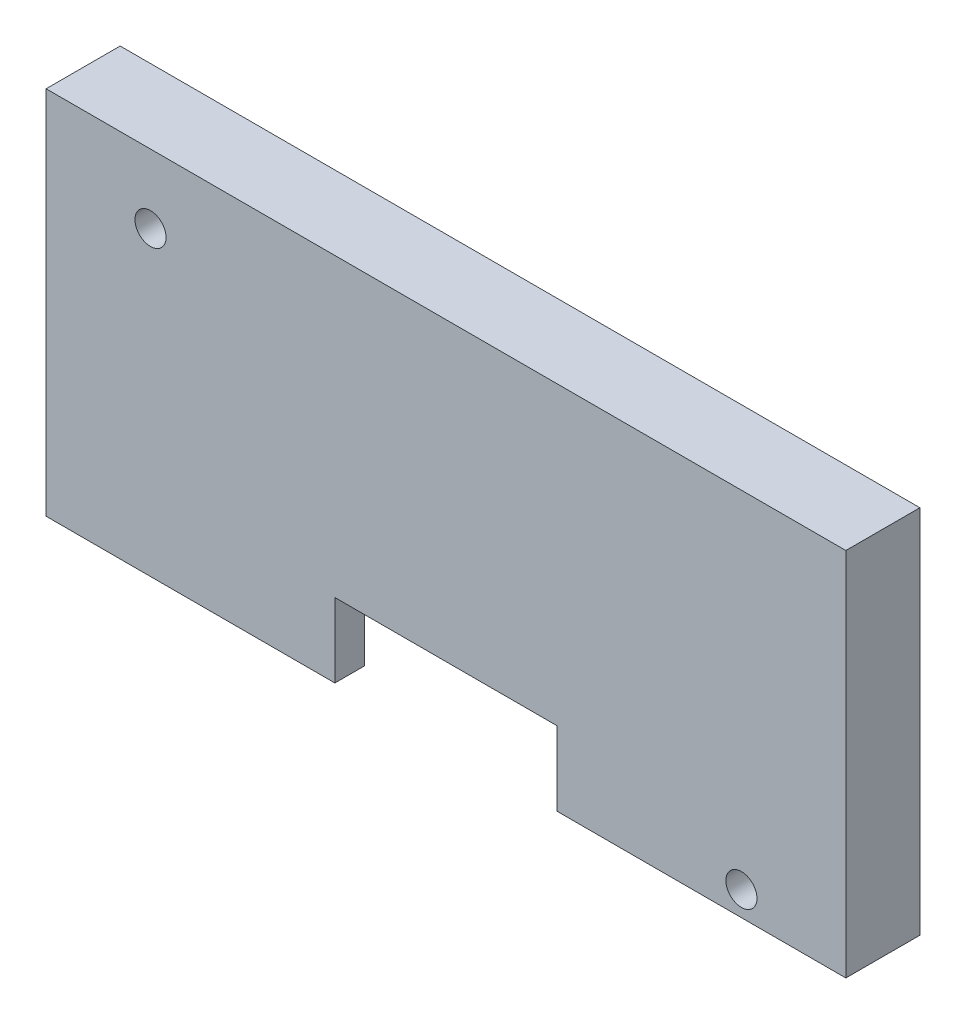
ISO-10303-21;
HEADER;
FILE_DESCRIPTION(('STEP AP214'),'2;1');
FILE_NAME('part.step','',(''),(''),'','','');
FILE_SCHEMA(('AUTOMOTIVE_DESIGN { 1 0 10303 214 1 1 1 1 }'));
ENDSEC;
DATA;
#1=APPLICATION_CONTEXT('core data for automotive mechanical design processes');
#2=APPLICATION_PROTOCOL_DEFINITION('international standard','automotive_design',2000,#1);
#3=PRODUCT_CONTEXT('',#1,'mechanical');
#4=PRODUCT('Part','Part','',(#3));
#5=PRODUCT_RELATED_PRODUCT_CATEGORY('part','',(#4));
#6=PRODUCT_DEFINITION_FORMATION('','',#4);
#7=PRODUCT_DEFINITION_CONTEXT('part definition',#1,'design');
#8=PRODUCT_DEFINITION('design','',#6,#7);
#9=PRODUCT_DEFINITION_SHAPE('','',#8);
#10=(LENGTH_UNIT() NAMED_UNIT(*) SI_UNIT(.MILLI.,.METRE.));
#11=(NAMED_UNIT(*) PLANE_ANGLE_UNIT() SI_UNIT($,.RADIAN.));
#12=(NAMED_UNIT(*) SI_UNIT($,.STERADIAN.) SOLID_ANGLE_UNIT());
#13=UNCERTAINTY_MEASURE_WITH_UNIT(LENGTH_MEASURE(1.E-05),#10,'distance_accuracy_value','');
#14=(GEOMETRIC_REPRESENTATION_CONTEXT(3) GLOBAL_UNCERTAINTY_ASSIGNED_CONTEXT((#13)) GLOBAL_UNIT_ASSIGNED_CONTEXT((#10,
#11,#12)) REPRESENTATION_CONTEXT('',''));
#15=CARTESIAN_POINT('',(0.,0.,0.));
#16=DIRECTION('',(0.,0.,1.));
#17=DIRECTION('',(1.,0.,0.));
#18=AXIS2_PLACEMENT_3D('',#15,#16,#17);
#19=CARTESIAN_POINT('',(-16.9631728808427,-17.5815625675434,5.));
#20=DIRECTION('',(0.,1.,0.));
#21=DIRECTION('',(0.,0.,1.));
#22=AXIS2_PLACEMENT_3D('',#19,#20,#21);
#23=PLANE('',#22);
#24=DIRECTION('',(0.,0.,-1.));
#25=VECTOR('',#24,1.);
#26=CARTESIAN_POINT('',(17.5368271191573,-17.5815625675434,18.));
#27=LINE('',#26,#25);
#28=CARTESIAN_POINT('',(17.5368271191573,-17.5815625675434,5.));
#29=VERTEX_POINT('',#28);
#30=CARTESIAN_POINT('',(17.5368271191573,-17.5815625675434,3.));
#31=VERTEX_POINT('',#30);
#32=EDGE_CURVE('E126',#29,#31,#27,.T.);
#33=ORIENTED_EDGE('',*,*,#32,.T.);
#34=DIRECTION('',(1.,0.,0.));
#35=VECTOR('',#34,1.);
#36=CARTESIAN_POINT('',(-14.9631728808427,-17.5815625675434,3.));
#37=LINE('',#36,#35);
#38=CARTESIAN_POINT('',(35.0368271191573,-17.5815625675434,3.));
#39=VERTEX_POINT('',#38);
#40=EDGE_CURVE('E205',#31,#39,#37,.T.);
#41=ORIENTED_EDGE('',*,*,#40,.T.);
#42=DIRECTION('',(0.,0.,-1.));
#43=VECTOR('',#42,1.);
#44=CARTESIAN_POINT('',(35.0368271191573,-17.5815625675434,3.));
#45=LINE('',#44,#43);
#46=CARTESIAN_POINT('',(35.0368271191573,-17.5815625675434,0.));
#47=VERTEX_POINT('',#46);
#48=EDGE_CURVE('E232',#39,#47,#45,.T.);
#49=ORIENTED_EDGE('',*,*,#48,.T.);
#50=DIRECTION('',(1.,0.,0.));
#51=VECTOR('',#50,1.);
#52=CARTESIAN_POINT('',(-16.9631728808427,-17.5815625675434,0.));
#53=LINE('',#52,#51);
#54=CARTESIAN_POINT('',(37.0368271191573,-17.5815625675434,0.));
#55=VERTEX_POINT('',#54);
#56=EDGE_CURVE('E168',#47,#55,#53,.T.);
#57=ORIENTED_EDGE('',*,*,#56,.T.);
#58=DIRECTION('',(0.,0.,-1.));
#59=VECTOR('',#58,1.);
#60=CARTESIAN_POINT('',(37.0368271191573,-17.5815625675434,5.));
#61=LINE('',#60,#59);
#62=CARTESIAN_POINT('',(37.0368271191573,-17.5815625675434,5.));
#63=VERTEX_POINT('',#62);
#64=EDGE_CURVE('E148',#63,#55,#61,.T.);
#65=ORIENTED_EDGE('',*,*,#64,.F.);
#66=DIRECTION('',(1.,0.,0.));
#67=VECTOR('',#66,1.);
#68=CARTESIAN_POINT('',(-16.9631728808427,-17.5815625675434,5.));
#69=LINE('',#68,#67);
#70=EDGE_CURVE('E141',#29,#63,#69,.T.);
#71=ORIENTED_EDGE('',*,*,#70,.F.);
#72=EDGE_LOOP('',(#33,#41,#49,#57,#65,#71));
#73=FACE_BOUND('',#72,.T.);
#74=ADVANCED_FACE('F38',(#73),#23,.F.);
#75=DIRECTION('',(0.,0.,-1.));
#76=VECTOR('',#75,1.);
#77=CARTESIAN_POINT('',(2.53682711915725,-17.5815625675434,18.));
#78=LINE('',#77,#76);
#79=CARTESIAN_POINT('',(2.53682711915725,-17.5815625675434,5.));
#80=VERTEX_POINT('',#79);
#81=CARTESIAN_POINT('',(2.53682711915725,-17.5815625675434,3.));
#82=VERTEX_POINT('',#81);
#83=EDGE_CURVE('E53',#80,#82,#78,.T.);
#84=ORIENTED_EDGE('',*,*,#83,.F.);
#85=CARTESIAN_POINT('',(-16.9631728808427,-17.5815625675434,5.));
#86=VERTEX_POINT('',#85);
#87=EDGE_CURVE('E150',#86,#80,#69,.T.);
#88=ORIENTED_EDGE('',*,*,#87,.F.);
#89=DIRECTION('',(0.,0.,-1.));
#90=VECTOR('',#89,1.);
#91=CARTESIAN_POINT('',(-16.9631728808427,-17.5815625675434,5.));
#92=LINE('',#91,#90);
#93=CARTESIAN_POINT('',(-16.9631728808427,-17.5815625675434,0.));
#94=VERTEX_POINT('',#93);
#95=EDGE_CURVE('E182',#86,#94,#92,.T.);
#96=ORIENTED_EDGE('',*,*,#95,.T.);
#97=CARTESIAN_POINT('',(-14.9631728808427,-17.5815625675434,0.));
#98=VERTEX_POINT('',#97);
#99=EDGE_CURVE('E170',#94,#98,#53,.T.);
#100=ORIENTED_EDGE('',*,*,#99,.T.);
#101=DIRECTION('',(0.,0.,-1.));
#102=VECTOR('',#101,1.);
#103=CARTESIAN_POINT('',(-14.9631728808427,-17.5815625675434,3.));
#104=LINE('',#103,#102);
#105=CARTESIAN_POINT('',(-14.9631728808427,-17.5815625675434,3.));
#106=VERTEX_POINT('',#105);
#107=EDGE_CURVE('E169',#106,#98,#104,.T.);
#108=ORIENTED_EDGE('',*,*,#107,.F.);
#109=EDGE_CURVE('E210',#106,#82,#37,.T.);
#110=ORIENTED_EDGE('',*,*,#109,.T.);
#111=EDGE_LOOP('',(#84,#88,#96,#100,#108,#110));
#112=FACE_BOUND('',#111,.T.);
#113=ADVANCED_FACE('F241',(#112),#23,.F.);
#114=CARTESIAN_POINT('',(0.,0.,5.));
#115=DIRECTION('',(0.,0.,1.));
#116=DIRECTION('',(1.,0.,0.));
#117=AXIS2_PLACEMENT_3D('',#114,#115,#116);
#118=PLANE('',#117);
#119=CARTESIAN_POINT('',(-9.91317288084275,2.76843743245664,5.));
#120=DIRECTION('',(0.,0.,1.));
#121=DIRECTION('',(1.,0.,0.));
#122=AXIS2_PLACEMENT_3D('',#119,#120,#121);
#123=CIRCLE('',#122,1.05);
#124=CARTESIAN_POINT('',(-8.86317288084275,2.76843743245664,5.));
#125=VERTEX_POINT('',#124);
#126=EDGE_CURVE('E192',#125,#125,#123,.F.);
#127=ORIENTED_EDGE('',*,*,#126,.T.);
#128=EDGE_LOOP('',(#127));
#129=FACE_BOUND('',#128,.T.);
#130=CARTESIAN_POINT('',(29.9868271191573,-15.9315625675434,5.));
#131=DIRECTION('',(0.,0.,1.));
#132=DIRECTION('',(1.,0.,0.));
#133=AXIS2_PLACEMENT_3D('',#130,#131,#132);
#134=CIRCLE('',#133,1.05);
#135=CARTESIAN_POINT('',(31.0368271191573,-15.9315625675434,5.));
#136=VERTEX_POINT('',#135);
#137=EDGE_CURVE('E188',#136,#136,#134,.F.);
#138=ORIENTED_EDGE('',*,*,#137,.T.);
#139=EDGE_LOOP('',(#138));
#140=FACE_BOUND('',#139,.T.);
#141=DIRECTION('',(1.,0.,0.));
#142=VECTOR('',#141,1.);
#143=CARTESIAN_POINT('',(0.,-12.5815625675434,5.));
#144=LINE('',#143,#142);
#145=CARTESIAN_POINT('',(2.53682711915725,-12.5815625675434,5.));
#146=VERTEX_POINT('',#145);
#147=CARTESIAN_POINT('',(17.5368271191573,-12.5815625675434,5.));
#148=VERTEX_POINT('',#147);
#149=EDGE_CURVE('E144',#146,#148,#144,.T.);
#150=ORIENTED_EDGE('',*,*,#149,.T.);
#151=DIRECTION('',(0.,-1.,0.));
#152=VECTOR('',#151,1.);
#153=CARTESIAN_POINT('',(17.5368271191573,0.,5.));
#154=LINE('',#153,#152);
#155=EDGE_CURVE('E130',#148,#29,#154,.T.);
#156=ORIENTED_EDGE('',*,*,#155,.T.);
#157=ORIENTED_EDGE('',*,*,#70,.T.);
#158=DIRECTION('',(0.,-1.,0.));
#159=VECTOR('',#158,1.);
#160=CARTESIAN_POINT('',(37.0368271191573,7.41843743245665,5.));
#161=LINE('',#160,#159);
#162=CARTESIAN_POINT('',(37.0368271191573,7.41843743245665,5.));
#163=VERTEX_POINT('',#162);
#164=EDGE_CURVE('E154',#163,#63,#161,.T.);
#165=ORIENTED_EDGE('',*,*,#164,.F.);
#166=DIRECTION('',(1.,0.,0.));
#167=VECTOR('',#166,1.);
#168=CARTESIAN_POINT('',(-16.9631728808428,7.41843743245665,5.));
#169=LINE('',#168,#167);
#170=CARTESIAN_POINT('',(-16.9631728808428,7.41843743245665,5.));
#171=VERTEX_POINT('',#170);
#172=EDGE_CURVE('E161',#171,#163,#169,.T.);
#173=ORIENTED_EDGE('',*,*,#172,.F.);
#174=DIRECTION('',(0.,-1.,0.));
#175=VECTOR('',#174,1.);
#176=CARTESIAN_POINT('',(-16.9631728808428,7.41843743245665,5.));
#177=LINE('',#176,#175);
#178=EDGE_CURVE('E151',#171,#86,#177,.T.);
#179=ORIENTED_EDGE('',*,*,#178,.T.);
#180=ORIENTED_EDGE('',*,*,#87,.T.);
#181=DIRECTION('',(0.,1.,0.));
#182=VECTOR('',#181,1.);
#183=CARTESIAN_POINT('',(2.53682711915725,0.,5.));
#184=LINE('',#183,#182);
#185=EDGE_CURVE('E201',#80,#146,#184,.T.);
#186=ORIENTED_EDGE('',*,*,#185,.T.);
#187=EDGE_LOOP('',(#150,#156,#157,#165,#173,#179,#180,#186));
#188=FACE_BOUND('',#187,.T.);
#189=ADVANCED_FACE('F139',(#129,#140,#188),#118,.T.);
#190=CARTESIAN_POINT('',(0.,0.,3.));
#191=DIRECTION('',(0.,0.,1.));
#192=DIRECTION('',(1.,0.,0.));
#193=AXIS2_PLACEMENT_3D('',#190,#191,#192);
#194=PLANE('',#193);
#195=CARTESIAN_POINT('',(29.9868271191573,-15.9315625675434,3.));
#196=DIRECTION('',(0.,0.,1.));
#197=DIRECTION('',(1.,0.,0.));
#198=AXIS2_PLACEMENT_3D('',#195,#196,#197);
#199=CIRCLE('',#198,1.05);
#200=CARTESIAN_POINT('',(31.0368271191573,-15.9315625675434,3.));
#201=VERTEX_POINT('',#200);
#202=EDGE_CURVE('E145',#201,#201,#199,.F.);
#203=ORIENTED_EDGE('',*,*,#202,.F.);
#204=EDGE_LOOP('',(#203));
#205=FACE_BOUND('',#204,.T.);
#206=CARTESIAN_POINT('',(-9.91317288084275,2.76843743245664,3.));
#207=DIRECTION('',(0.,0.,1.));
#208=DIRECTION('',(1.,0.,0.));
#209=AXIS2_PLACEMENT_3D('',#206,#207,#208);
#210=CIRCLE('',#209,1.05);
#211=CARTESIAN_POINT('',(-8.86317288084275,2.76843743245664,3.));
#212=VERTEX_POINT('',#211);
#213=EDGE_CURVE('E189',#212,#212,#210,.F.);
#214=ORIENTED_EDGE('',*,*,#213,.F.);
#215=EDGE_LOOP('',(#214));
#216=FACE_BOUND('',#215,.T.);
#217=DIRECTION('',(0.,-1.,0.));
#218=VECTOR('',#217,1.);
#219=CARTESIAN_POINT('',(17.5368271191573,0.,3.));
#220=LINE('',#219,#218);
#221=CARTESIAN_POINT('',(17.5368271191573,-12.5815625675434,3.));
#222=VERTEX_POINT('',#221);
#223=EDGE_CURVE('E11',#222,#31,#220,.T.);
#224=ORIENTED_EDGE('',*,*,#223,.F.);
#225=DIRECTION('',(1.,0.,0.));
#226=VECTOR('',#225,1.);
#227=CARTESIAN_POINT('',(0.,-12.5815625675434,3.));
#228=LINE('',#227,#226);
#229=CARTESIAN_POINT('',(2.53682711915725,-12.5815625675434,3.));
#230=VERTEX_POINT('',#229);
#231=EDGE_CURVE('E46',#230,#222,#228,.T.);
#232=ORIENTED_EDGE('',*,*,#231,.F.);
#233=DIRECTION('',(0.,1.,0.));
#234=VECTOR('',#233,1.);
#235=CARTESIAN_POINT('',(2.53682711915725,0.,3.));
#236=LINE('',#235,#234);
#237=EDGE_CURVE('E185',#82,#230,#236,.T.);
#238=ORIENTED_EDGE('',*,*,#237,.F.);
#239=ORIENTED_EDGE('',*,*,#109,.F.);
#240=DIRECTION('',(0.,-1.,0.));
#241=VECTOR('',#240,1.);
#242=CARTESIAN_POINT('',(-14.9631728808427,4.41843743245664,3.));
#243=LINE('',#242,#241);
#244=CARTESIAN_POINT('',(-14.9631728808427,4.41843743245664,3.));
#245=VERTEX_POINT('',#244);
#246=EDGE_CURVE('E211',#245,#106,#243,.T.);
#247=ORIENTED_EDGE('',*,*,#246,.F.);
#248=DIRECTION('',(-1.,0.,0.));
#249=VECTOR('',#248,1.);
#250=CARTESIAN_POINT('',(-14.9631728808427,4.41843743245664,3.));
#251=LINE('',#250,#249);
#252=CARTESIAN_POINT('',(35.0368271191573,4.41843743245664,3.));
#253=VERTEX_POINT('',#252);
#254=EDGE_CURVE('E220',#253,#245,#251,.T.);
#255=ORIENTED_EDGE('',*,*,#254,.F.);
#256=DIRECTION('',(0.,1.,0.));
#257=VECTOR('',#256,1.);
#258=CARTESIAN_POINT('',(35.0368271191573,4.41843743245664,3.));
#259=LINE('',#258,#257);
#260=EDGE_CURVE('E207',#39,#253,#259,.T.);
#261=ORIENTED_EDGE('',*,*,#260,.F.);
#262=ORIENTED_EDGE('',*,*,#40,.F.);
#263=EDGE_LOOP('',(#224,#232,#238,#239,#247,#255,#261,#262));
#264=FACE_BOUND('',#263,.T.);
#265=ADVANCED_FACE('F203',(#205,#216,#264),#194,.F.);
#266=CARTESIAN_POINT('',(0.,0.,0.));
#267=DIRECTION('',(0.,0.,1.));
#268=DIRECTION('',(1.,0.,0.));
#269=AXIS2_PLACEMENT_3D('',#266,#267,#268);
#270=PLANE('',#269);
#271=DIRECTION('',(0.,-1.,0.));
#272=VECTOR('',#271,1.);
#273=CARTESIAN_POINT('',(-14.9631728808427,4.41843743245664,0.));
#274=LINE('',#273,#272);
#275=CARTESIAN_POINT('',(-14.9631728808427,4.41843743245664,0.));
#276=VERTEX_POINT('',#275);
#277=EDGE_CURVE('E61',#276,#98,#274,.T.);
#278=ORIENTED_EDGE('',*,*,#277,.T.);
#279=ORIENTED_EDGE('',*,*,#99,.F.);
#280=DIRECTION('',(0.,-1.,0.));
#281=VECTOR('',#280,1.);
#282=CARTESIAN_POINT('',(-16.9631728808428,7.41843743245665,0.));
#283=LINE('',#282,#281);
#284=CARTESIAN_POINT('',(-16.9631728808428,7.41843743245665,0.));
#285=VERTEX_POINT('',#284);
#286=EDGE_CURVE('E165',#285,#94,#283,.T.);
#287=ORIENTED_EDGE('',*,*,#286,.F.);
#288=DIRECTION('',(1.,0.,0.));
#289=VECTOR('',#288,1.);
#290=CARTESIAN_POINT('',(-16.9631728808428,7.41843743245665,0.));
#291=LINE('',#290,#289);
#292=CARTESIAN_POINT('',(37.0368271191573,7.41843743245665,0.));
#293=VERTEX_POINT('',#292);
#294=EDGE_CURVE('E156',#285,#293,#291,.T.);
#295=ORIENTED_EDGE('',*,*,#294,.T.);
#296=DIRECTION('',(0.,-1.,0.));
#297=VECTOR('',#296,1.);
#298=CARTESIAN_POINT('',(37.0368271191573,7.41843743245665,0.));
#299=LINE('',#298,#297);
#300=EDGE_CURVE('E173',#293,#55,#299,.T.);
#301=ORIENTED_EDGE('',*,*,#300,.T.);
#302=ORIENTED_EDGE('',*,*,#56,.F.);
#303=DIRECTION('',(0.,1.,0.));
#304=VECTOR('',#303,1.);
#305=CARTESIAN_POINT('',(35.0368271191573,4.41843743245664,0.));
#306=LINE('',#305,#304);
#307=CARTESIAN_POINT('',(35.0368271191573,4.41843743245664,0.));
#308=VERTEX_POINT('',#307);
#309=EDGE_CURVE('E224',#47,#308,#306,.T.);
#310=ORIENTED_EDGE('',*,*,#309,.T.);
#311=DIRECTION('',(-1.,0.,0.));
#312=VECTOR('',#311,1.);
#313=CARTESIAN_POINT('',(-14.9631728808427,4.41843743245664,0.));
#314=LINE('',#313,#312);
#315=EDGE_CURVE('E215',#308,#276,#314,.T.);
#316=ORIENTED_EDGE('',*,*,#315,.T.);
#317=EDGE_LOOP('',(#278,#279,#287,#295,#301,#302,#310,#316));
#318=FACE_BOUND('',#317,.T.);
#319=ADVANCED_FACE('F238',(#318),#270,.F.);
#320=CARTESIAN_POINT('',(-16.9631728808428,7.41843743245665,5.));
#321=DIRECTION('',(1.,0.,0.));
#322=DIRECTION('',(0.,1.,0.));
#323=AXIS2_PLACEMENT_3D('',#320,#321,#322);
#324=PLANE('',#323);
#325=ORIENTED_EDGE('',*,*,#286,.T.);
#326=ORIENTED_EDGE('',*,*,#95,.F.);
#327=ORIENTED_EDGE('',*,*,#178,.F.);
#328=DIRECTION('',(0.,0.,-1.));
#329=VECTOR('',#328,1.);
#330=CARTESIAN_POINT('',(-16.9631728808428,7.41843743245665,5.));
#331=LINE('',#330,#329);
#332=EDGE_CURVE('E164',#171,#285,#331,.T.);
#333=ORIENTED_EDGE('',*,*,#332,.T.);
#334=EDGE_LOOP('',(#325,#326,#327,#333));
#335=FACE_BOUND('',#334,.T.);
#336=ADVANCED_FACE('F40',(#335),#324,.F.);
#337=CARTESIAN_POINT('',(37.0368271191573,7.41843743245665,5.));
#338=DIRECTION('',(1.,0.,0.));
#339=DIRECTION('',(0.,1.,0.));
#340=AXIS2_PLACEMENT_3D('',#337,#338,#339);
#341=PLANE('',#340);
#342=ORIENTED_EDGE('',*,*,#300,.F.);
#343=DIRECTION('',(0.,0.,-1.));
#344=VECTOR('',#343,1.);
#345=CARTESIAN_POINT('',(37.0368271191573,7.41843743245665,5.));
#346=LINE('',#345,#344);
#347=EDGE_CURVE('E179',#163,#293,#346,.T.);
#348=ORIENTED_EDGE('',*,*,#347,.F.);
#349=ORIENTED_EDGE('',*,*,#164,.T.);
#350=ORIENTED_EDGE('',*,*,#64,.T.);
#351=EDGE_LOOP('',(#342,#348,#349,#350));
#352=FACE_BOUND('',#351,.T.);
#353=ADVANCED_FACE('F251',(#352),#341,.T.);
#354=CARTESIAN_POINT('',(-16.9631728808428,7.41843743245665,5.));
#355=DIRECTION('',(0.,1.,0.));
#356=DIRECTION('',(0.,0.,1.));
#357=AXIS2_PLACEMENT_3D('',#354,#355,#356);
#358=PLANE('',#357);
#359=ORIENTED_EDGE('',*,*,#294,.F.);
#360=ORIENTED_EDGE('',*,*,#332,.F.);
#361=ORIENTED_EDGE('',*,*,#172,.T.);
#362=ORIENTED_EDGE('',*,*,#347,.T.);
#363=EDGE_LOOP('',(#359,#360,#361,#362));
#364=FACE_BOUND('',#363,.T.);
#365=ADVANCED_FACE('F247',(#364),#358,.T.);
#366=CARTESIAN_POINT('',(-14.9631728808427,4.41843743245664,3.));
#367=DIRECTION('',(1.,0.,0.));
#368=DIRECTION('',(0.,0.,-1.));
#369=AXIS2_PLACEMENT_3D('',#366,#367,#368);
#370=PLANE('',#369);
#371=ORIENTED_EDGE('',*,*,#277,.F.);
#372=DIRECTION('',(0.,0.,-1.));
#373=VECTOR('',#372,1.);
#374=CARTESIAN_POINT('',(-14.9631728808427,4.41843743245664,3.));
#375=LINE('',#374,#373);
#376=EDGE_CURVE('E222',#245,#276,#375,.T.);
#377=ORIENTED_EDGE('',*,*,#376,.F.);
#378=ORIENTED_EDGE('',*,*,#246,.T.);
#379=ORIENTED_EDGE('',*,*,#107,.T.);
#380=EDGE_LOOP('',(#371,#377,#378,#379));
#381=FACE_BOUND('',#380,.T.);
#382=ADVANCED_FACE('F234',(#381),#370,.T.);
#383=CARTESIAN_POINT('',(35.0368271191573,4.41843743245664,3.));
#384=DIRECTION('',(-1.,0.,0.));
#385=DIRECTION('',(0.,0.,1.));
#386=AXIS2_PLACEMENT_3D('',#383,#384,#385);
#387=PLANE('',#386);
#388=ORIENTED_EDGE('',*,*,#309,.F.);
#389=ORIENTED_EDGE('',*,*,#48,.F.);
#390=ORIENTED_EDGE('',*,*,#260,.T.);
#391=DIRECTION('',(0.,0.,-1.));
#392=VECTOR('',#391,1.);
#393=CARTESIAN_POINT('',(35.0368271191573,4.41843743245664,3.));
#394=LINE('',#393,#392);
#395=EDGE_CURVE('E230',#253,#308,#394,.T.);
#396=ORIENTED_EDGE('',*,*,#395,.T.);
#397=EDGE_LOOP('',(#388,#389,#390,#396));
#398=FACE_BOUND('',#397,.T.);
#399=ADVANCED_FACE('F254',(#398),#387,.T.);
#400=CARTESIAN_POINT('',(-14.9631728808427,4.41843743245664,3.));
#401=DIRECTION('',(0.,-1.,0.));
#402=DIRECTION('',(0.,0.,-1.));
#403=AXIS2_PLACEMENT_3D('',#400,#401,#402);
#404=PLANE('',#403);
#405=ORIENTED_EDGE('',*,*,#315,.F.);
#406=ORIENTED_EDGE('',*,*,#395,.F.);
#407=ORIENTED_EDGE('',*,*,#254,.T.);
#408=ORIENTED_EDGE('',*,*,#376,.T.);
#409=EDGE_LOOP('',(#405,#406,#407,#408));
#410=FACE_BOUND('',#409,.T.);
#411=ADVANCED_FACE('F257',(#410),#404,.T.);
#412=CARTESIAN_POINT('',(29.9868271191573,-15.9315625675434,17.));
#413=DIRECTION('',(0.,0.,-1.));
#414=DIRECTION('',(-1.,0.,0.));
#415=AXIS2_PLACEMENT_3D('',#412,#413,#414);
#416=CYLINDRICAL_SURFACE('',#415,1.05);
#417=ORIENTED_EDGE('',*,*,#137,.F.);
#418=EDGE_LOOP('',(#417));
#419=FACE_BOUND('',#418,.T.);
#420=ORIENTED_EDGE('',*,*,#202,.T.);
#421=EDGE_LOOP('',(#420));
#422=FACE_BOUND('',#421,.T.);
#423=ADVANCED_FACE('F272',(#419,#422),#416,.F.);
#424=CARTESIAN_POINT('',(-9.91317288084275,2.76843743245664,17.));
#425=DIRECTION('',(0.,0.,-1.));
#426=DIRECTION('',(-1.,0.,0.));
#427=AXIS2_PLACEMENT_3D('',#424,#425,#426);
#428=CYLINDRICAL_SURFACE('',#427,1.05);
#429=ORIENTED_EDGE('',*,*,#126,.F.);
#430=EDGE_LOOP('',(#429));
#431=FACE_BOUND('',#430,.T.);
#432=ORIENTED_EDGE('',*,*,#213,.T.);
#433=EDGE_LOOP('',(#432));
#434=FACE_BOUND('',#433,.T.);
#435=ADVANCED_FACE('F269',(#431,#434),#428,.F.);
#436=CARTESIAN_POINT('',(17.5368271191573,-12.5815625675434,18.));
#437=DIRECTION('',(-1.,0.,0.));
#438=DIRECTION('',(0.,0.,1.));
#439=AXIS2_PLACEMENT_3D('',#436,#437,#438);
#440=PLANE('',#439);
#441=DIRECTION('',(0.,0.,-1.));
#442=VECTOR('',#441,1.);
#443=CARTESIAN_POINT('',(17.5368271191573,-12.5815625675434,18.));
#444=LINE('',#443,#442);
#445=EDGE_CURVE('E197',#148,#222,#444,.T.);
#446=ORIENTED_EDGE('',*,*,#445,.T.);
#447=ORIENTED_EDGE('',*,*,#223,.T.);
#448=ORIENTED_EDGE('',*,*,#32,.F.);
#449=ORIENTED_EDGE('',*,*,#155,.F.);
#450=EDGE_LOOP('',(#446,#447,#448,#449));
#451=FACE_BOUND('',#450,.T.);
#452=ADVANCED_FACE('F129',(#451),#440,.T.);
#453=CARTESIAN_POINT('',(17.5368271191573,-12.5815625675434,18.));
#454=DIRECTION('',(0.,-1.,0.));
#455=DIRECTION('',(1.,0.,0.));
#456=AXIS2_PLACEMENT_3D('',#453,#454,#455);
#457=PLANE('',#456);
#458=DIRECTION('',(0.,0.,-1.));
#459=VECTOR('',#458,1.);
#460=CARTESIAN_POINT('',(2.53682711915725,-12.5815625675434,18.));
#461=LINE('',#460,#459);
#462=EDGE_CURVE('E199',#146,#230,#461,.T.);
#463=ORIENTED_EDGE('',*,*,#462,.T.);
#464=ORIENTED_EDGE('',*,*,#231,.T.);
#465=ORIENTED_EDGE('',*,*,#445,.F.);
#466=ORIENTED_EDGE('',*,*,#149,.F.);
#467=EDGE_LOOP('',(#463,#464,#465,#466));
#468=FACE_BOUND('',#467,.T.);
#469=ADVANCED_FACE('F196',(#468),#457,.T.);
#470=CARTESIAN_POINT('',(2.53682711915725,-12.5815625675434,18.));
#471=DIRECTION('',(1.,0.,0.));
#472=DIRECTION('',(0.,1.,0.));
#473=AXIS2_PLACEMENT_3D('',#470,#471,#472);
#474=PLANE('',#473);
#475=ORIENTED_EDGE('',*,*,#83,.T.);
#476=ORIENTED_EDGE('',*,*,#237,.T.);
#477=ORIENTED_EDGE('',*,*,#462,.F.);
#478=ORIENTED_EDGE('',*,*,#185,.F.);
#479=EDGE_LOOP('',(#475,#476,#477,#478));
#480=FACE_BOUND('',#479,.T.);
#481=ADVANCED_FACE('F314',(#480),#474,.T.);
#482=CLOSED_SHELL('',(#74,#113,#189,#265,#319,#336,#353,#365,#382,#399,#411,#423,#435,#452,#469,#481));
#483=MANIFOLD_SOLID_BREP('B2',#482);
#484=ADVANCED_BREP_SHAPE_REPRESENTATION('',(#18,#483),#14);
#485=SHAPE_DEFINITION_REPRESENTATION(#9,#484);
ENDSEC;
END-ISO-10303-21;
